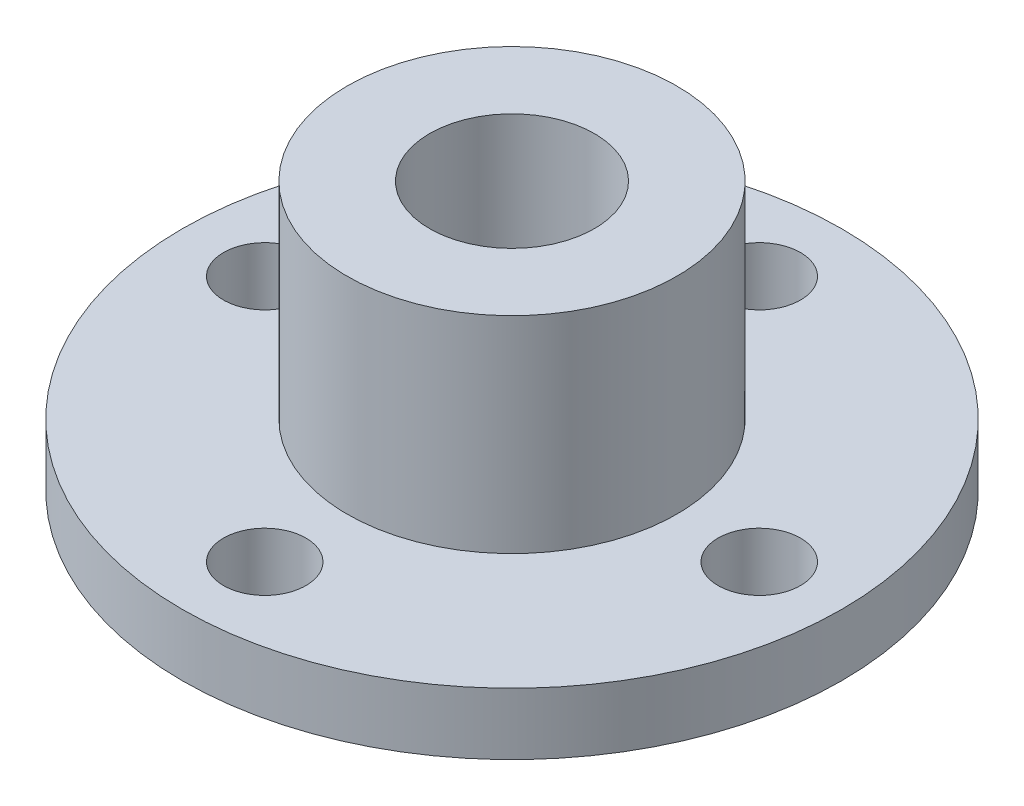
ISO-10303-21;
HEADER;
FILE_DESCRIPTION(('STEP AP214'),'2;1');
FILE_NAME('part.step','',(''),(''),'','','');
FILE_SCHEMA(('AUTOMOTIVE_DESIGN { 1 0 10303 214 1 1 1 1 }'));
ENDSEC;
DATA;
#1=APPLICATION_CONTEXT('core data for automotive mechanical design processes');
#2=APPLICATION_PROTOCOL_DEFINITION('international standard','automotive_design',2000,#1);
#3=PRODUCT_CONTEXT('',#1,'mechanical');
#4=PRODUCT('Part','Part','',(#3));
#5=PRODUCT_RELATED_PRODUCT_CATEGORY('part','',(#4));
#6=PRODUCT_DEFINITION_FORMATION('','',#4);
#7=PRODUCT_DEFINITION_CONTEXT('part definition',#1,'design');
#8=PRODUCT_DEFINITION('design','',#6,#7);
#9=PRODUCT_DEFINITION_SHAPE('','',#8);
#10=(LENGTH_UNIT() NAMED_UNIT(*) SI_UNIT(.MILLI.,.METRE.));
#11=(NAMED_UNIT(*) PLANE_ANGLE_UNIT() SI_UNIT($,.RADIAN.));
#12=(NAMED_UNIT(*) SI_UNIT($,.STERADIAN.) SOLID_ANGLE_UNIT());
#13=UNCERTAINTY_MEASURE_WITH_UNIT(LENGTH_MEASURE(1.E-05),#10,'distance_accuracy_value','');
#14=(GEOMETRIC_REPRESENTATION_CONTEXT(3) GLOBAL_UNCERTAINTY_ASSIGNED_CONTEXT((#13)) GLOBAL_UNIT_ASSIGNED_CONTEXT((#10,
#11,#12)) REPRESENTATION_CONTEXT('',''));
#15=CARTESIAN_POINT('',(0.,0.,0.));
#16=DIRECTION('',(0.,0.,1.));
#17=DIRECTION('',(1.,0.,0.));
#18=AXIS2_PLACEMENT_3D('',#15,#16,#17);
#19=CARTESIAN_POINT('',(0.,1.5,0.));
#20=DIRECTION('',(0.,1.,0.));
#21=DIRECTION('',(1.,0.,0.));
#22=AXIS2_PLACEMENT_3D('',#19,#20,#21);
#23=CYLINDRICAL_SURFACE('',#22,16.);
#24=CARTESIAN_POINT('',(0.,3.,0.));
#25=DIRECTION('',(0.,1.,0.));
#26=DIRECTION('',(1.,0.,0.));
#27=AXIS2_PLACEMENT_3D('',#24,#25,#26);
#28=CIRCLE('',#27,16.);
#29=CARTESIAN_POINT('',(-16.,3.,0.));
#30=VERTEX_POINT('',#29);
#31=EDGE_CURVE('E94',#30,#30,#28,.T.);
#32=ORIENTED_EDGE('',*,*,#31,.F.);
#33=DIRECTION('',(0.,-1.,0.));
#34=VECTOR('',#33,1.);
#35=CARTESIAN_POINT('',(-16.,1.5,0.));
#36=LINE('',#35,#34);
#37=CARTESIAN_POINT('',(-16.,0.,0.));
#38=VERTEX_POINT('',#37);
#39=EDGE_CURVE('E11',#30,#38,#36,.T.);
#40=ORIENTED_EDGE('',*,*,#39,.T.);
#41=CARTESIAN_POINT('',(0.,0.,0.));
#42=DIRECTION('',(0.,1.,0.));
#43=DIRECTION('',(1.,0.,0.));
#44=AXIS2_PLACEMENT_3D('',#41,#42,#43);
#45=CIRCLE('',#44,16.);
#46=EDGE_CURVE('E28',#38,#38,#45,.T.);
#47=ORIENTED_EDGE('',*,*,#46,.T.);
#48=ORIENTED_EDGE('',*,*,#39,.F.);
#49=EDGE_LOOP('',(#32,#40,#47,#48));
#50=FACE_BOUND('',#49,.T.);
#51=ADVANCED_FACE('F17',(#50),#23,.T.);
#52=CARTESIAN_POINT('',(16.,0.,0.));
#53=DIRECTION('',(0.,-1.,0.));
#54=DIRECTION('',(0.,0.,-1.));
#55=AXIS2_PLACEMENT_3D('',#52,#53,#54);
#56=PLANE('',#55);
#57=CARTESIAN_POINT('',(0.,0.,0.));
#58=DIRECTION('',(0.,1.,0.));
#59=DIRECTION('',(1.,0.,0.));
#60=AXIS2_PLACEMENT_3D('',#57,#58,#59);
#61=CIRCLE('',#60,4.);
#62=CARTESIAN_POINT('',(-4.,0.,0.));
#63=VERTEX_POINT('',#62);
#64=EDGE_CURVE('E127',#63,#63,#61,.T.);
#65=ORIENTED_EDGE('',*,*,#64,.T.);
#66=EDGE_LOOP('',(#65));
#67=FACE_BOUND('',#66,.T.);
#68=CARTESIAN_POINT('',(-12.,0.,0.));
#69=DIRECTION('',(0.,1.,0.));
#70=DIRECTION('',(1.,0.,0.));
#71=AXIS2_PLACEMENT_3D('',#68,#69,#70);
#72=CIRCLE('',#71,2.);
#73=CARTESIAN_POINT('',(-14.,0.,0.));
#74=VERTEX_POINT('',#73);
#75=EDGE_CURVE('E130',#74,#74,#72,.T.);
#76=ORIENTED_EDGE('',*,*,#75,.T.);
#77=EDGE_LOOP('',(#76));
#78=FACE_BOUND('',#77,.T.);
#79=CARTESIAN_POINT('',(0.,0.,-12.));
#80=DIRECTION('',(0.,1.,0.));
#81=DIRECTION('',(1.,0.,0.));
#82=AXIS2_PLACEMENT_3D('',#79,#80,#81);
#83=CIRCLE('',#82,2.);
#84=CARTESIAN_POINT('',(-2.,0.,-12.));
#85=VERTEX_POINT('',#84);
#86=EDGE_CURVE('E138',#85,#85,#83,.T.);
#87=ORIENTED_EDGE('',*,*,#86,.T.);
#88=EDGE_LOOP('',(#87));
#89=FACE_BOUND('',#88,.T.);
#90=CARTESIAN_POINT('',(0.,0.,12.));
#91=DIRECTION('',(0.,1.,0.));
#92=DIRECTION('',(1.,0.,0.));
#93=AXIS2_PLACEMENT_3D('',#90,#91,#92);
#94=CIRCLE('',#93,2.);
#95=CARTESIAN_POINT('',(-2.,0.,12.));
#96=VERTEX_POINT('',#95);
#97=EDGE_CURVE('E98',#96,#96,#94,.T.);
#98=ORIENTED_EDGE('',*,*,#97,.T.);
#99=EDGE_LOOP('',(#98));
#100=FACE_BOUND('',#99,.T.);
#101=CARTESIAN_POINT('',(12.,0.,0.));
#102=DIRECTION('',(0.,1.,0.));
#103=DIRECTION('',(1.,0.,0.));
#104=AXIS2_PLACEMENT_3D('',#101,#102,#103);
#105=CIRCLE('',#104,2.);
#106=CARTESIAN_POINT('',(10.,0.,0.));
#107=VERTEX_POINT('',#106);
#108=EDGE_CURVE('E123',#107,#107,#105,.T.);
#109=ORIENTED_EDGE('',*,*,#108,.T.);
#110=EDGE_LOOP('',(#109));
#111=FACE_BOUND('',#110,.T.);
#112=ORIENTED_EDGE('',*,*,#46,.F.);
#113=EDGE_LOOP('',(#112));
#114=FACE_BOUND('',#113,.T.);
#115=ADVANCED_FACE('F168',(#67,#78,#89,#100,#111,#114),#56,.T.);
#116=CARTESIAN_POINT('',(0.,6.5,0.));
#117=DIRECTION('',(0.,1.,0.));
#118=DIRECTION('',(1.,0.,0.));
#119=AXIS2_PLACEMENT_3D('',#116,#117,#118);
#120=CYLINDRICAL_SURFACE('',#119,4.);
#121=CARTESIAN_POINT('',(0.,13.,0.));
#122=DIRECTION('',(0.,1.,0.));
#123=DIRECTION('',(1.,0.,0.));
#124=AXIS2_PLACEMENT_3D('',#121,#122,#123);
#125=CIRCLE('',#124,4.);
#126=CARTESIAN_POINT('',(-4.,13.,0.));
#127=VERTEX_POINT('',#126);
#128=EDGE_CURVE('E84',#127,#127,#125,.T.);
#129=ORIENTED_EDGE('',*,*,#128,.T.);
#130=DIRECTION('',(0.,-1.,0.));
#131=VECTOR('',#130,1.);
#132=CARTESIAN_POINT('',(-4.,6.5,0.));
#133=LINE('',#132,#131);
#134=EDGE_CURVE('E70',#127,#63,#133,.T.);
#135=ORIENTED_EDGE('',*,*,#134,.T.);
#136=ORIENTED_EDGE('',*,*,#64,.F.);
#137=ORIENTED_EDGE('',*,*,#134,.F.);
#138=EDGE_LOOP('',(#129,#135,#136,#137));
#139=FACE_BOUND('',#138,.T.);
#140=ADVANCED_FACE('F171',(#139),#120,.F.);
#141=CARTESIAN_POINT('',(4.,13.,0.));
#142=DIRECTION('',(0.,1.,0.));
#143=DIRECTION('',(1.,0.,0.));
#144=AXIS2_PLACEMENT_3D('',#141,#142,#143);
#145=PLANE('',#144);
#146=ORIENTED_EDGE('',*,*,#128,.F.);
#147=EDGE_LOOP('',(#146));
#148=FACE_BOUND('',#147,.T.);
#149=CARTESIAN_POINT('',(0.,13.,0.));
#150=DIRECTION('',(0.,1.,0.));
#151=DIRECTION('',(1.,0.,0.));
#152=AXIS2_PLACEMENT_3D('',#149,#150,#151);
#153=CIRCLE('',#152,8.);
#154=CARTESIAN_POINT('',(-8.,13.,0.));
#155=VERTEX_POINT('',#154);
#156=EDGE_CURVE('E80',#155,#155,#153,.T.);
#157=ORIENTED_EDGE('',*,*,#156,.T.);
#158=EDGE_LOOP('',(#157));
#159=FACE_BOUND('',#158,.T.);
#160=ADVANCED_FACE('F87',(#148,#159),#145,.T.);
#161=CARTESIAN_POINT('',(0.,8.,0.));
#162=DIRECTION('',(0.,1.,0.));
#163=DIRECTION('',(1.,0.,0.));
#164=AXIS2_PLACEMENT_3D('',#161,#162,#163);
#165=CYLINDRICAL_SURFACE('',#164,8.);
#166=ORIENTED_EDGE('',*,*,#156,.F.);
#167=DIRECTION('',(0.,-1.,0.));
#168=VECTOR('',#167,1.);
#169=CARTESIAN_POINT('',(-8.,8.,0.));
#170=LINE('',#169,#168);
#171=CARTESIAN_POINT('',(-8.,3.,0.));
#172=VERTEX_POINT('',#171);
#173=EDGE_CURVE('E77',#155,#172,#170,.T.);
#174=ORIENTED_EDGE('',*,*,#173,.T.);
#175=CARTESIAN_POINT('',(0.,3.,0.));
#176=DIRECTION('',(0.,1.,0.));
#177=DIRECTION('',(1.,0.,0.));
#178=AXIS2_PLACEMENT_3D('',#175,#176,#177);
#179=CIRCLE('',#178,8.);
#180=EDGE_CURVE('E82',#172,#172,#179,.T.);
#181=ORIENTED_EDGE('',*,*,#180,.T.);
#182=ORIENTED_EDGE('',*,*,#173,.F.);
#183=EDGE_LOOP('',(#166,#174,#181,#182));
#184=FACE_BOUND('',#183,.T.);
#185=ADVANCED_FACE('F79',(#184),#165,.T.);
#186=CARTESIAN_POINT('',(8.,3.,0.));
#187=DIRECTION('',(0.,1.,0.));
#188=DIRECTION('',(1.,0.,0.));
#189=AXIS2_PLACEMENT_3D('',#186,#187,#188);
#190=PLANE('',#189);
#191=ORIENTED_EDGE('',*,*,#180,.F.);
#192=EDGE_LOOP('',(#191));
#193=FACE_BOUND('',#192,.T.);
#194=CARTESIAN_POINT('',(-12.,3.,0.));
#195=DIRECTION('',(0.,-1.,0.));
#196=DIRECTION('',(1.,0.,0.));
#197=AXIS2_PLACEMENT_3D('',#194,#195,#196);
#198=CIRCLE('',#197,2.);
#199=CARTESIAN_POINT('',(-14.,3.,0.));
#200=VERTEX_POINT('',#199);
#201=EDGE_CURVE('E148',#200,#200,#198,.T.);
#202=ORIENTED_EDGE('',*,*,#201,.T.);
#203=EDGE_LOOP('',(#202));
#204=FACE_BOUND('',#203,.T.);
#205=CARTESIAN_POINT('',(0.,3.,-12.));
#206=DIRECTION('',(0.,-1.,0.));
#207=DIRECTION('',(1.,0.,0.));
#208=AXIS2_PLACEMENT_3D('',#205,#206,#207);
#209=CIRCLE('',#208,2.);
#210=CARTESIAN_POINT('',(-2.,3.,-12.));
#211=VERTEX_POINT('',#210);
#212=EDGE_CURVE('E100',#211,#211,#209,.T.);
#213=ORIENTED_EDGE('',*,*,#212,.T.);
#214=EDGE_LOOP('',(#213));
#215=FACE_BOUND('',#214,.T.);
#216=CARTESIAN_POINT('',(0.,3.,12.));
#217=DIRECTION('',(0.,-1.,0.));
#218=DIRECTION('',(1.,0.,0.));
#219=AXIS2_PLACEMENT_3D('',#216,#217,#218);
#220=CIRCLE('',#219,2.);
#221=CARTESIAN_POINT('',(-2.,3.,12.));
#222=VERTEX_POINT('',#221);
#223=EDGE_CURVE('E113',#222,#222,#220,.T.);
#224=ORIENTED_EDGE('',*,*,#223,.T.);
#225=EDGE_LOOP('',(#224));
#226=FACE_BOUND('',#225,.T.);
#227=CARTESIAN_POINT('',(12.,3.,0.));
#228=DIRECTION('',(0.,-1.,0.));
#229=DIRECTION('',(1.,0.,0.));
#230=AXIS2_PLACEMENT_3D('',#227,#228,#229);
#231=CIRCLE('',#230,2.);
#232=CARTESIAN_POINT('',(10.,3.,0.));
#233=VERTEX_POINT('',#232);
#234=EDGE_CURVE('E139',#233,#233,#231,.T.);
#235=ORIENTED_EDGE('',*,*,#234,.T.);
#236=EDGE_LOOP('',(#235));
#237=FACE_BOUND('',#236,.T.);
#238=ORIENTED_EDGE('',*,*,#31,.T.);
#239=EDGE_LOOP('',(#238));
#240=FACE_BOUND('',#239,.T.);
#241=ADVANCED_FACE('F19',(#193,#204,#215,#226,#237,#240),#190,.T.);
#242=CARTESIAN_POINT('',(-12.,3.,0.));
#243=DIRECTION('',(0.,-1.,0.));
#244=DIRECTION('',(1.,0.,0.));
#245=AXIS2_PLACEMENT_3D('',#242,#243,#244);
#246=CYLINDRICAL_SURFACE('',#245,2.);
#247=ORIENTED_EDGE('',*,*,#201,.F.);
#248=DIRECTION('',(0.,-1.,0.));
#249=VECTOR('',#248,1.);
#250=CARTESIAN_POINT('',(-14.,3.,0.));
#251=LINE('',#250,#249);
#252=EDGE_CURVE('E149',#200,#74,#251,.T.);
#253=ORIENTED_EDGE('',*,*,#252,.T.);
#254=ORIENTED_EDGE('',*,*,#75,.F.);
#255=ORIENTED_EDGE('',*,*,#252,.F.);
#256=EDGE_LOOP('',(#247,#253,#254,#255));
#257=FACE_BOUND('',#256,.T.);
#258=ADVANCED_FACE('F165',(#257),#246,.F.);
#259=CARTESIAN_POINT('',(0.,3.,-12.));
#260=DIRECTION('',(0.,-1.,0.));
#261=DIRECTION('',(1.,0.,0.));
#262=AXIS2_PLACEMENT_3D('',#259,#260,#261);
#263=CYLINDRICAL_SURFACE('',#262,2.);
#264=ORIENTED_EDGE('',*,*,#212,.F.);
#265=DIRECTION('',(0.,-1.,0.));
#266=VECTOR('',#265,1.);
#267=CARTESIAN_POINT('',(-2.,3.,-12.));
#268=LINE('',#267,#266);
#269=EDGE_CURVE('E109',#211,#85,#268,.T.);
#270=ORIENTED_EDGE('',*,*,#269,.T.);
#271=ORIENTED_EDGE('',*,*,#86,.F.);
#272=ORIENTED_EDGE('',*,*,#269,.F.);
#273=EDGE_LOOP('',(#264,#270,#271,#272));
#274=FACE_BOUND('',#273,.T.);
#275=ADVANCED_FACE('F197',(#274),#263,.F.);
#276=CARTESIAN_POINT('',(0.,3.,12.));
#277=DIRECTION('',(0.,-1.,0.));
#278=DIRECTION('',(1.,0.,0.));
#279=AXIS2_PLACEMENT_3D('',#276,#277,#278);
#280=CYLINDRICAL_SURFACE('',#279,2.);
#281=ORIENTED_EDGE('',*,*,#223,.F.);
#282=DIRECTION('',(0.,-1.,0.));
#283=VECTOR('',#282,1.);
#284=CARTESIAN_POINT('',(-2.,3.,12.));
#285=LINE('',#284,#283);
#286=EDGE_CURVE('E101',#222,#96,#285,.T.);
#287=ORIENTED_EDGE('',*,*,#286,.T.);
#288=ORIENTED_EDGE('',*,*,#97,.F.);
#289=ORIENTED_EDGE('',*,*,#286,.F.);
#290=EDGE_LOOP('',(#281,#287,#288,#289));
#291=FACE_BOUND('',#290,.T.);
#292=ADVANCED_FACE('F199',(#291),#280,.F.);
#293=CARTESIAN_POINT('',(12.,3.,0.));
#294=DIRECTION('',(0.,-1.,0.));
#295=DIRECTION('',(1.,0.,0.));
#296=AXIS2_PLACEMENT_3D('',#293,#294,#295);
#297=CYLINDRICAL_SURFACE('',#296,2.);
#298=ORIENTED_EDGE('',*,*,#234,.F.);
#299=DIRECTION('',(0.,-1.,0.));
#300=VECTOR('',#299,1.);
#301=CARTESIAN_POINT('',(10.,3.,0.));
#302=LINE('',#301,#300);
#303=EDGE_CURVE('E21',#233,#107,#302,.T.);
#304=ORIENTED_EDGE('',*,*,#303,.T.);
#305=ORIENTED_EDGE('',*,*,#108,.F.);
#306=ORIENTED_EDGE('',*,*,#303,.F.);
#307=EDGE_LOOP('',(#298,#304,#305,#306));
#308=FACE_BOUND('',#307,.T.);
#309=ADVANCED_FACE('F204',(#308),#297,.F.);
#310=CLOSED_SHELL('',(#51,#115,#140,#160,#185,#241,#258,#275,#292,#309));
#311=MANIFOLD_SOLID_BREP('B1',#310);
#312=ADVANCED_BREP_SHAPE_REPRESENTATION('',(#18,#311),#14);
#313=SHAPE_DEFINITION_REPRESENTATION(#9,#312);
ENDSEC;
END-ISO-10303-21;
